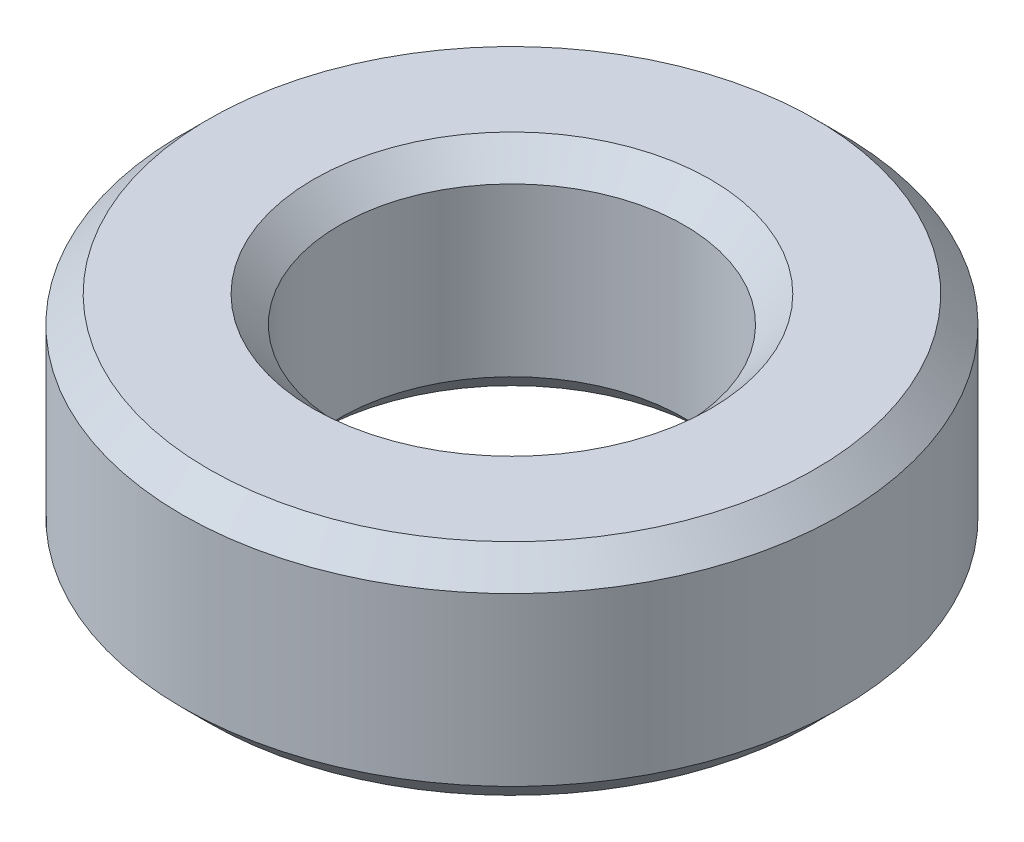
ISO-10303-21;
HEADER;
FILE_DESCRIPTION(('STEP AP214'),'2;1');
FILE_NAME('part.step','',(''),(''),'','','');
FILE_SCHEMA(('AUTOMOTIVE_DESIGN { 1 0 10303 214 1 1 1 1 }'));
ENDSEC;
DATA;
#1=APPLICATION_CONTEXT('core data for automotive mechanical design processes');
#2=APPLICATION_PROTOCOL_DEFINITION('international standard','automotive_design',2000,#1);
#3=PRODUCT_CONTEXT('',#1,'mechanical');
#4=PRODUCT('Part','Part','',(#3));
#5=PRODUCT_RELATED_PRODUCT_CATEGORY('part','',(#4));
#6=PRODUCT_DEFINITION_FORMATION('','',#4);
#7=PRODUCT_DEFINITION_CONTEXT('part definition',#1,'design');
#8=PRODUCT_DEFINITION('design','',#6,#7);
#9=PRODUCT_DEFINITION_SHAPE('','',#8);
#10=(LENGTH_UNIT() NAMED_UNIT(*) SI_UNIT(.MILLI.,.METRE.));
#11=(NAMED_UNIT(*) PLANE_ANGLE_UNIT() SI_UNIT($,.RADIAN.));
#12=(NAMED_UNIT(*) SI_UNIT($,.STERADIAN.) SOLID_ANGLE_UNIT());
#13=UNCERTAINTY_MEASURE_WITH_UNIT(LENGTH_MEASURE(1.E-05),#10,'distance_accuracy_value','');
#14=(GEOMETRIC_REPRESENTATION_CONTEXT(3) GLOBAL_UNCERTAINTY_ASSIGNED_CONTEXT((#13)) GLOBAL_UNIT_ASSIGNED_CONTEXT((#10,
#11,#12)) REPRESENTATION_CONTEXT('',''));
#15=CARTESIAN_POINT('',(0.,0.,0.));
#16=DIRECTION('',(0.,0.,1.));
#17=DIRECTION('',(1.,0.,0.));
#18=AXIS2_PLACEMENT_3D('',#15,#16,#17);
#19=CARTESIAN_POINT('',(0.,1.5875,0.));
#20=DIRECTION('',(0.,1.,0.));
#21=DIRECTION('',(0.,0.,1.));
#22=AXIS2_PLACEMENT_3D('',#19,#20,#21);
#23=PLANE('',#22);
#24=CARTESIAN_POINT('',(0.,1.5875,0.));
#25=DIRECTION('',(0.,1.,0.));
#26=DIRECTION('',(0.,0.,1.));
#27=AXIS2_PLACEMENT_3D('',#24,#25,#26);
#28=CIRCLE('',#27,2.8702);
#29=CARTESIAN_POINT('',(0.,1.5875,2.8702));
#30=VERTEX_POINT('',#29);
#31=EDGE_CURVE('E10',#30,#30,#28,.F.);
#32=ORIENTED_EDGE('',*,*,#31,.T.);
#33=EDGE_LOOP('',(#32));
#34=FACE_BOUND('',#33,.T.);
#35=CARTESIAN_POINT('',(0.,1.5875,0.));
#36=DIRECTION('',(0.,1.,0.));
#37=DIRECTION('',(0.,0.,1.));
#38=AXIS2_PLACEMENT_3D('',#35,#36,#37);
#39=CIRCLE('',#38,4.3815);
#40=CARTESIAN_POINT('',(0.,1.5875,4.3815));
#41=VERTEX_POINT('',#40);
#42=EDGE_CURVE('E43',#41,#41,#39,.T.);
#43=ORIENTED_EDGE('',*,*,#42,.T.);
#44=EDGE_LOOP('',(#43));
#45=FACE_BOUND('',#44,.T.);
#46=ADVANCED_FACE('F35',(#34,#45),#23,.T.);
#47=CARTESIAN_POINT('',(0.,-1.5875,0.));
#48=DIRECTION('',(0.,1.,0.));
#49=DIRECTION('',(0.,0.,1.));
#50=AXIS2_PLACEMENT_3D('',#47,#48,#49);
#51=PLANE('',#50);
#52=CARTESIAN_POINT('',(0.,-1.5875,0.));
#53=DIRECTION('',(0.,1.,0.));
#54=DIRECTION('',(0.,0.,1.));
#55=AXIS2_PLACEMENT_3D('',#52,#53,#54);
#56=CIRCLE('',#55,2.8702);
#57=CARTESIAN_POINT('',(0.,-1.5875,2.8702));
#58=VERTEX_POINT('',#57);
#59=EDGE_CURVE('E62',#58,#58,#56,.T.);
#60=ORIENTED_EDGE('',*,*,#59,.T.);
#61=EDGE_LOOP('',(#60));
#62=FACE_BOUND('',#61,.T.);
#63=CARTESIAN_POINT('',(0.,-1.5875,0.));
#64=DIRECTION('',(0.,1.,0.));
#65=DIRECTION('',(0.,0.,1.));
#66=AXIS2_PLACEMENT_3D('',#63,#64,#65);
#67=CIRCLE('',#66,4.3815);
#68=CARTESIAN_POINT('',(0.,-1.5875,4.3815));
#69=VERTEX_POINT('',#68);
#70=EDGE_CURVE('E65',#69,#69,#67,.F.);
#71=ORIENTED_EDGE('',*,*,#70,.T.);
#72=EDGE_LOOP('',(#71));
#73=FACE_BOUND('',#72,.T.);
#74=ADVANCED_FACE('F69',(#62,#73),#51,.F.);
#75=CARTESIAN_POINT('',(0.,1.5875,0.));
#76=DIRECTION('',(0.,-1.,0.));
#77=DIRECTION('',(0.,0.,-1.));
#78=AXIS2_PLACEMENT_3D('',#75,#76,#77);
#79=CYLINDRICAL_SURFACE('',#78,4.7625);
#80=CARTESIAN_POINT('',(0.,-1.2065,0.));
#81=DIRECTION('',(0.,1.,0.));
#82=DIRECTION('',(0.,0.,1.));
#83=AXIS2_PLACEMENT_3D('',#80,#81,#82);
#84=CIRCLE('',#83,4.7625);
#85=CARTESIAN_POINT('',(0.,-1.2065,4.7625));
#86=VERTEX_POINT('',#85);
#87=EDGE_CURVE('E47',#86,#86,#84,.T.);
#88=ORIENTED_EDGE('',*,*,#87,.T.);
#89=EDGE_LOOP('',(#88));
#90=FACE_BOUND('',#89,.T.);
#91=CARTESIAN_POINT('',(0.,1.2065,0.));
#92=DIRECTION('',(0.,1.,0.));
#93=DIRECTION('',(0.,0.,1.));
#94=AXIS2_PLACEMENT_3D('',#91,#92,#93);
#95=CIRCLE('',#94,4.7625);
#96=CARTESIAN_POINT('',(0.,1.2065,4.7625));
#97=VERTEX_POINT('',#96);
#98=EDGE_CURVE('E51',#97,#97,#95,.F.);
#99=ORIENTED_EDGE('',*,*,#98,.T.);
#100=EDGE_LOOP('',(#99));
#101=FACE_BOUND('',#100,.T.);
#102=ADVANCED_FACE('F79',(#90,#101),#79,.T.);
#103=CARTESIAN_POINT('',(0.,1.5875,0.));
#104=DIRECTION('',(0.,-1.,0.));
#105=DIRECTION('',(0.,0.,-1.));
#106=AXIS2_PLACEMENT_3D('',#103,#104,#105);
#107=CYLINDRICAL_SURFACE('',#106,2.4892);
#108=CARTESIAN_POINT('',(0.,-1.2065,0.));
#109=DIRECTION('',(0.,1.,0.));
#110=DIRECTION('',(0.,0.,1.));
#111=AXIS2_PLACEMENT_3D('',#108,#109,#110);
#112=CIRCLE('',#111,2.4892);
#113=CARTESIAN_POINT('',(0.,-1.2065,2.4892));
#114=VERTEX_POINT('',#113);
#115=EDGE_CURVE('E56',#114,#114,#112,.F.);
#116=ORIENTED_EDGE('',*,*,#115,.T.);
#117=EDGE_LOOP('',(#116));
#118=FACE_BOUND('',#117,.T.);
#119=CARTESIAN_POINT('',(0.,1.2065,0.));
#120=DIRECTION('',(0.,1.,0.));
#121=DIRECTION('',(0.,0.,1.));
#122=AXIS2_PLACEMENT_3D('',#119,#120,#121);
#123=CIRCLE('',#122,2.4892);
#124=CARTESIAN_POINT('',(0.,1.2065,2.4892));
#125=VERTEX_POINT('',#124);
#126=EDGE_CURVE('E59',#125,#125,#123,.T.);
#127=ORIENTED_EDGE('',*,*,#126,.T.);
#128=EDGE_LOOP('',(#127));
#129=FACE_BOUND('',#128,.T.);
#130=ADVANCED_FACE('F82',(#118,#129),#107,.F.);
#131=CARTESIAN_POINT('',(0.,-1.5875,0.));
#132=DIRECTION('',(0.,-1.,0.));
#133=DIRECTION('',(0.,0.,-1.));
#134=AXIS2_PLACEMENT_3D('',#131,#132,#133);
#135=CONICAL_SURFACE('',#134,2.8702,0.785398163397447);
#136=ORIENTED_EDGE('',*,*,#115,.F.);
#137=EDGE_LOOP('',(#136));
#138=FACE_BOUND('',#137,.T.);
#139=ORIENTED_EDGE('',*,*,#59,.F.);
#140=EDGE_LOOP('',(#139));
#141=FACE_BOUND('',#140,.T.);
#142=ADVANCED_FACE('F75',(#138,#141),#135,.F.);
#143=CARTESIAN_POINT('',(0.,-1.2065,0.));
#144=DIRECTION('',(0.,1.,0.));
#145=DIRECTION('',(0.,0.,1.));
#146=AXIS2_PLACEMENT_3D('',#143,#144,#145);
#147=CONICAL_SURFACE('',#146,4.7625,0.785398163397451);
#148=ORIENTED_EDGE('',*,*,#70,.F.);
#149=EDGE_LOOP('',(#148));
#150=FACE_BOUND('',#149,.T.);
#151=ORIENTED_EDGE('',*,*,#87,.F.);
#152=EDGE_LOOP('',(#151));
#153=FACE_BOUND('',#152,.T.);
#154=ADVANCED_FACE('F71',(#150,#153),#147,.T.);
#155=CARTESIAN_POINT('',(0.,1.2065,0.));
#156=DIRECTION('',(0.,1.,0.));
#157=DIRECTION('',(0.,0.,1.));
#158=AXIS2_PLACEMENT_3D('',#155,#156,#157);
#159=CONICAL_SURFACE('',#158,2.4892,0.785398163397451);
#160=ORIENTED_EDGE('',*,*,#31,.F.);
#161=EDGE_LOOP('',(#160));
#162=FACE_BOUND('',#161,.T.);
#163=ORIENTED_EDGE('',*,*,#126,.F.);
#164=EDGE_LOOP('',(#163));
#165=FACE_BOUND('',#164,.T.);
#166=ADVANCED_FACE('F74',(#162,#165),#159,.F.);
#167=CARTESIAN_POINT('',(0.,1.5875,0.));
#168=DIRECTION('',(0.,-1.,0.));
#169=DIRECTION('',(0.,0.,-1.));
#170=AXIS2_PLACEMENT_3D('',#167,#168,#169);
#171=CONICAL_SURFACE('',#170,4.3815,0.785398163397444);
#172=ORIENTED_EDGE('',*,*,#98,.F.);
#173=EDGE_LOOP('',(#172));
#174=FACE_BOUND('',#173,.T.);
#175=ORIENTED_EDGE('',*,*,#42,.F.);
#176=EDGE_LOOP('',(#175));
#177=FACE_BOUND('',#176,.T.);
#178=ADVANCED_FACE('F38',(#174,#177),#171,.T.);
#179=CLOSED_SHELL('',(#46,#74,#102,#130,#142,#154,#166,#178));
#180=MANIFOLD_SOLID_BREP('B2',#179);
#181=ADVANCED_BREP_SHAPE_REPRESENTATION('',(#18,#180),#14);
#182=SHAPE_DEFINITION_REPRESENTATION(#9,#181);
ENDSEC;
END-ISO-10303-21;
